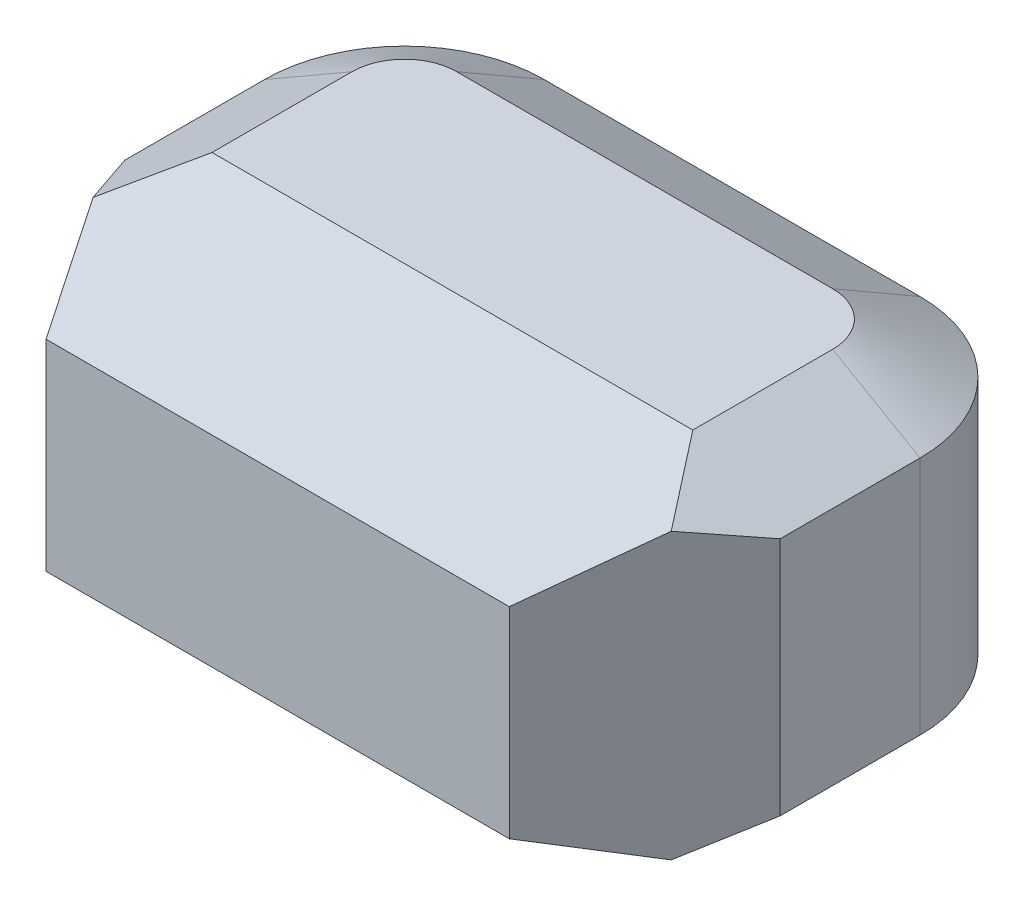
ISO-10303-21;
HEADER;
FILE_DESCRIPTION(('STEP AP214'),'2;1');
FILE_NAME('part.step','',(''),(''),'','','');
FILE_SCHEMA(('AUTOMOTIVE_DESIGN { 1 0 10303 214 1 1 1 1 }'));
ENDSEC;
DATA;
#1=APPLICATION_CONTEXT('core data for automotive mechanical design processes');
#2=APPLICATION_PROTOCOL_DEFINITION('international standard','automotive_design',2000,#1);
#3=PRODUCT_CONTEXT('',#1,'mechanical');
#4=PRODUCT('Part','Part','',(#3));
#5=PRODUCT_RELATED_PRODUCT_CATEGORY('part','',(#4));
#6=PRODUCT_DEFINITION_FORMATION('','',#4);
#7=PRODUCT_DEFINITION_CONTEXT('part definition',#1,'design');
#8=PRODUCT_DEFINITION('design','',#6,#7);
#9=PRODUCT_DEFINITION_SHAPE('','',#8);
#10=(LENGTH_UNIT() NAMED_UNIT(*) SI_UNIT(.MILLI.,.METRE.));
#11=(NAMED_UNIT(*) PLANE_ANGLE_UNIT() SI_UNIT($,.RADIAN.));
#12=(NAMED_UNIT(*) SI_UNIT($,.STERADIAN.) SOLID_ANGLE_UNIT());
#13=UNCERTAINTY_MEASURE_WITH_UNIT(LENGTH_MEASURE(1.E-05),#10,'distance_accuracy_value','');
#14=(GEOMETRIC_REPRESENTATION_CONTEXT(3) GLOBAL_UNCERTAINTY_ASSIGNED_CONTEXT((#13)) GLOBAL_UNIT_ASSIGNED_CONTEXT((#10,
#11,#12)) REPRESENTATION_CONTEXT('',''));
#15=CARTESIAN_POINT('',(0.,0.,0.));
#16=DIRECTION('',(0.,0.,1.));
#17=DIRECTION('',(1.,0.,0.));
#18=AXIS2_PLACEMENT_3D('',#15,#16,#17);
#19=CARTESIAN_POINT('',(-9.525,4.953,-10.668));
#20=DIRECTION('',(0.,-0.86602540378444,0.499999999999998));
#21=DIRECTION('',(0.,-0.499999999999998,-0.86602540378444));
#22=AXIS2_PLACEMENT_3D('',#19,#20,#21);
#23=PLANE('',#22);
#24=DIRECTION('',(1.,0.,0.));
#25=VECTOR('',#24,1.);
#26=CARTESIAN_POINT('',(-9.525,4.953,-10.668));
#27=LINE('',#26,#25);
#28=CARTESIAN_POINT('',(5.461,4.95300000000794,-10.6680000000112));
#29=VERTEX_POINT('',#28);
#30=CARTESIAN_POINT('',(-5.461,4.95300000000794,-10.6680000000112));
#31=VERTEX_POINT('',#30);
#32=EDGE_CURVE('E136',#29,#31,#27,.F.);
#33=ORIENTED_EDGE('',*,*,#32,.F.);
#34=DIRECTION('',(0.,0.499999999999998,0.86602540378444));
#35=VECTOR('',#34,1.);
#36=CARTESIAN_POINT('',(5.461,-288086.67215295,-499000.));
#37=LINE('',#36,#35);
#38=CARTESIAN_POINT('',(5.461,3.48653031627095,-13.2079999999766));
#39=VERTEX_POINT('',#38);
#40=EDGE_CURVE('E132',#39,#29,#37,.T.);
#41=ORIENTED_EDGE('',*,*,#40,.F.);
#42=DIRECTION('',(-1.,0.,0.));
#43=VECTOR('',#42,1.);
#44=CARTESIAN_POINT('',(-9.525,3.48653031625835,-13.208));
#45=LINE('',#44,#43);
#46=CARTESIAN_POINT('',(-5.461,3.48653031626934,-13.2079999999816));
#47=VERTEX_POINT('',#46);
#48=EDGE_CURVE('E228',#47,#39,#45,.F.);
#49=ORIENTED_EDGE('',*,*,#48,.F.);
#50=DIRECTION('',(0.,0.499999999999998,0.86602540378444));
#51=VECTOR('',#50,1.);
#52=CARTESIAN_POINT('',(-5.461,-288086.67215295,-499000.));
#53=LINE('',#52,#51);
#54=EDGE_CURVE('E180',#31,#47,#53,.F.);
#55=ORIENTED_EDGE('',*,*,#54,.F.);
#56=EDGE_LOOP('',(#33,#41,#49,#55));
#57=FACE_BOUND('',#56,.T.);
#58=ADVANCED_FACE('F16',(#57),#23,.F.);
#59=CARTESIAN_POINT('',(5.461,3.48653031630874,-9.144));
#60=DIRECTION('',(0.,-1.,0.));
#61=DIRECTION('',(0.,0.,-1.));
#62=AXIS2_PLACEMENT_3D('',#59,#60,#61);
#63=CONICAL_SURFACE('',#62,4.06399999990641,1.04719755118925);
#64=DIRECTION('',(0.86602540378444,-0.499999999999998,0.));
#65=VECTOR('',#64,1.);
#66=CARTESIAN_POINT('',(9.525,3.48653031625835,-9.144));
#67=LINE('',#66,#65);
#68=CARTESIAN_POINT('',(6.98499999998641,4.95300000000783,-9.144));
#69=VERTEX_POINT('',#68);
#70=CARTESIAN_POINT('',(9.525,3.48653031625835,-9.144));
#71=VERTEX_POINT('',#70);
#72=EDGE_CURVE('E129',#69,#71,#67,.T.);
#73=ORIENTED_EDGE('',*,*,#72,.T.);
#74=CARTESIAN_POINT('',(5.461,3.48653031625835,-9.144));
#75=DIRECTION('',(0.,1.,0.));
#76=DIRECTION('',(0.,0.,1.));
#77=AXIS2_PLACEMENT_3D('',#74,#75,#76);
#78=CIRCLE('',#77,4.064);
#79=EDGE_CURVE('E216',#39,#71,#78,.F.);
#80=ORIENTED_EDGE('',*,*,#79,.F.);
#81=ORIENTED_EDGE('',*,*,#40,.T.);
#82=CARTESIAN_POINT('',(5.461,4.95300000001566,-9.144));
#83=DIRECTION('',(0.,-1.,0.));
#84=DIRECTION('',(0.,0.,-1.));
#85=AXIS2_PLACEMENT_3D('',#82,#83,#84);
#86=CIRCLE('',#85,1.52400000000967);
#87=EDGE_CURVE('E19',#69,#29,#86,.F.);
#88=ORIENTED_EDGE('',*,*,#87,.F.);
#89=EDGE_LOOP('',(#73,#80,#81,#88));
#90=FACE_BOUND('',#89,.T.);
#91=ADVANCED_FACE('F127',(#90),#63,.T.);
#92=CARTESIAN_POINT('',(-9.525,4.953,-13.208));
#93=DIRECTION('',(0.,0.,-1.));
#94=DIRECTION('',(-1.,0.,0.));
#95=AXIS2_PLACEMENT_3D('',#92,#93,#94);
#96=PLANE('',#95);
#97=DIRECTION('',(0.,-1.,0.));
#98=VECTOR('',#97,1.);
#99=CARTESIAN_POINT('',(-5.461,-4.953,-13.208));
#100=LINE('',#99,#98);
#101=CARTESIAN_POINT('',(-5.461,-3.48653031629615,-13.2079999999856));
#102=VERTEX_POINT('',#101);
#103=EDGE_CURVE('E214',#47,#102,#100,.T.);
#104=ORIENTED_EDGE('',*,*,#103,.F.);
#105=ORIENTED_EDGE('',*,*,#48,.T.);
#106=DIRECTION('',(0.,1.,0.));
#107=VECTOR('',#106,1.);
#108=CARTESIAN_POINT('',(5.461,-4.953,-13.208));
#109=LINE('',#108,#107);
#110=CARTESIAN_POINT('',(5.461,-3.48653031629615,-13.2079999999856));
#111=VERTEX_POINT('',#110);
#112=EDGE_CURVE('E225',#111,#39,#109,.T.);
#113=ORIENTED_EDGE('',*,*,#112,.F.);
#114=DIRECTION('',(1.,0.,0.));
#115=VECTOR('',#114,1.);
#116=CARTESIAN_POINT('',(-9.525,-3.48653031625835,-13.208));
#117=LINE('',#116,#115);
#118=EDGE_CURVE('E219',#111,#102,#117,.F.);
#119=ORIENTED_EDGE('',*,*,#118,.T.);
#120=EDGE_LOOP('',(#104,#105,#113,#119));
#121=FACE_BOUND('',#120,.T.);
#122=ADVANCED_FACE('F394',(#121),#96,.T.);
#123=CARTESIAN_POINT('',(5.461,-4.953,-9.144));
#124=DIRECTION('',(0.,1.,0.));
#125=DIRECTION('',(0.,0.,1.));
#126=AXIS2_PLACEMENT_3D('',#123,#124,#125);
#127=CYLINDRICAL_SURFACE('',#126,4.064);
#128=ORIENTED_EDGE('',*,*,#112,.T.);
#129=ORIENTED_EDGE('',*,*,#79,.T.);
#130=DIRECTION('',(0.,1.,0.));
#131=VECTOR('',#130,1.);
#132=CARTESIAN_POINT('',(9.525,-4.953,-9.144));
#133=LINE('',#132,#131);
#134=CARTESIAN_POINT('',(9.52499999999479,-3.48653031627095,-9.144));
#135=VERTEX_POINT('',#134);
#136=EDGE_CURVE('E144',#135,#71,#133,.T.);
#137=ORIENTED_EDGE('',*,*,#136,.F.);
#138=CARTESIAN_POINT('',(5.461,-3.48653031630874,-9.144));
#139=DIRECTION('',(0.,1.,0.));
#140=DIRECTION('',(0.,0.,1.));
#141=AXIS2_PLACEMENT_3D('',#138,#139,#140);
#142=CIRCLE('',#141,4.06399999997915);
#143=EDGE_CURVE('E282',#111,#135,#142,.F.);
#144=ORIENTED_EDGE('',*,*,#143,.F.);
#145=EDGE_LOOP('',(#128,#129,#137,#144));
#146=FACE_BOUND('',#145,.T.);
#147=ADVANCED_FACE('F396',(#146),#127,.T.);
#148=CARTESIAN_POINT('',(-5.461,-4.953,-9.144));
#149=DIRECTION('',(0.,-1.,0.));
#150=DIRECTION('',(0.,0.,-1.));
#151=AXIS2_PLACEMENT_3D('',#148,#149,#150);
#152=CYLINDRICAL_SURFACE('',#151,4.064);
#153=DIRECTION('',(0.,1.,0.));
#154=VECTOR('',#153,1.);
#155=CARTESIAN_POINT('',(-9.525,-4.953,-9.144));
#156=LINE('',#155,#154);
#157=CARTESIAN_POINT('',(-9.52500000000502,3.48653031625673,-9.144));
#158=VERTEX_POINT('',#157);
#159=CARTESIAN_POINT('',(-9.52499999998936,-3.48653031628038,-9.144));
#160=VERTEX_POINT('',#159);
#161=EDGE_CURVE('E185',#158,#160,#156,.F.);
#162=ORIENTED_EDGE('',*,*,#161,.F.);
#163=CARTESIAN_POINT('',(-5.461,3.4865303162519,-9.144));
#164=DIRECTION('',(0.,-1.,0.));
#165=DIRECTION('',(0.,0.,-1.));
#166=AXIS2_PLACEMENT_3D('',#163,#164,#165);
#167=CIRCLE('',#166,4.06400000002009);
#168=EDGE_CURVE('E137',#47,#158,#167,.F.);
#169=ORIENTED_EDGE('',*,*,#168,.F.);
#170=ORIENTED_EDGE('',*,*,#103,.T.);
#171=CARTESIAN_POINT('',(-5.461,-3.48653031630874,-9.144));
#172=DIRECTION('',(0.,1.,0.));
#173=DIRECTION('',(0.,0.,1.));
#174=AXIS2_PLACEMENT_3D('',#171,#172,#173);
#175=CIRCLE('',#174,4.06399999997915);
#176=EDGE_CURVE('E189',#160,#102,#175,.F.);
#177=ORIENTED_EDGE('',*,*,#176,.F.);
#178=EDGE_LOOP('',(#162,#169,#170,#177));
#179=FACE_BOUND('',#178,.T.);
#180=ADVANCED_FACE('F574',(#179),#152,.T.);
#181=CARTESIAN_POINT('',(-5.461,3.48653031630874,-9.144));
#182=DIRECTION('',(0.,-1.,0.));
#183=DIRECTION('',(0.,0.,-1.));
#184=AXIS2_PLACEMENT_3D('',#181,#182,#183);
#185=CONICAL_SURFACE('',#184,4.06399999990641,1.04719755118925);
#186=ORIENTED_EDGE('',*,*,#54,.T.);
#187=ORIENTED_EDGE('',*,*,#168,.T.);
#188=DIRECTION('',(0.866025403784439,0.499999999999999,0.));
#189=VECTOR('',#188,1.);
#190=CARTESIAN_POINT('',(-6.98499999999998,4.953,-9.144));
#191=LINE('',#190,#189);
#192=CARTESIAN_POINT('',(-6.98499999998642,4.95300000000783,-9.144));
#193=VERTEX_POINT('',#192);
#194=EDGE_CURVE('E165',#158,#193,#191,.T.);
#195=ORIENTED_EDGE('',*,*,#194,.T.);
#196=CARTESIAN_POINT('',(-5.461,4.95300000001566,-9.144));
#197=DIRECTION('',(0.,-1.,0.));
#198=DIRECTION('',(0.,0.,-1.));
#199=AXIS2_PLACEMENT_3D('',#196,#197,#198);
#200=CIRCLE('',#199,1.52400000000967);
#201=EDGE_CURVE('E150',#31,#193,#200,.F.);
#202=ORIENTED_EDGE('',*,*,#201,.F.);
#203=EDGE_LOOP('',(#186,#187,#195,#202));
#204=FACE_BOUND('',#203,.T.);
#205=ADVANCED_FACE('F566',(#204),#185,.T.);
#206=CARTESIAN_POINT('',(-9.525,4.953,-13.208));
#207=DIRECTION('',(0.,1.,0.));
#208=DIRECTION('',(0.,0.,1.));
#209=AXIS2_PLACEMENT_3D('',#206,#207,#208);
#210=PLANE('',#209);
#211=ORIENTED_EDGE('',*,*,#201,.T.);
#212=DIRECTION('',(0.,0.,1.));
#213=VECTOR('',#212,1.);
#214=CARTESIAN_POINT('',(-6.98499999999998,4.953,-13.208));
#215=LINE('',#214,#213);
#216=CARTESIAN_POINT('',(-6.98499999999998,4.953,-5.08));
#217=VERTEX_POINT('',#216);
#218=EDGE_CURVE('E160',#193,#217,#215,.T.);
#219=ORIENTED_EDGE('',*,*,#218,.T.);
#220=DIRECTION('',(1.,0.,0.));
#221=VECTOR('',#220,1.);
#222=CARTESIAN_POINT('',(-10.16,4.953,-5.08));
#223=LINE('',#222,#221);
#224=CARTESIAN_POINT('',(6.98499999999998,4.953,-5.08));
#225=VERTEX_POINT('',#224);
#226=EDGE_CURVE('E149',#217,#225,#223,.T.);
#227=ORIENTED_EDGE('',*,*,#226,.T.);
#228=DIRECTION('',(0.,0.,1.));
#229=VECTOR('',#228,1.);
#230=CARTESIAN_POINT('',(6.98499999999998,4.953,-13.208));
#231=LINE('',#230,#229);
#232=EDGE_CURVE('E141',#225,#69,#231,.F.);
#233=ORIENTED_EDGE('',*,*,#232,.T.);
#234=ORIENTED_EDGE('',*,*,#87,.T.);
#235=ORIENTED_EDGE('',*,*,#32,.T.);
#236=EDGE_LOOP('',(#211,#219,#227,#233,#234,#235));
#237=FACE_BOUND('',#236,.T.);
#238=ADVANCED_FACE('F147',(#237),#210,.T.);
#239=CARTESIAN_POINT('',(9.525,3.48653031625835,-13.208));
#240=DIRECTION('',(-0.499999999999998,-0.86602540378444,0.));
#241=DIRECTION('',(0.86602540378444,-0.499999999999998,0.));
#242=AXIS2_PLACEMENT_3D('',#239,#240,#241);
#243=PLANE('',#242);
#244=DIRECTION('',(0.464282451503766,-0.268053598355716,-0.84414991182503));
#245=VECTOR('',#244,1.);
#246=CARTESIAN_POINT('',(8.4009437111578,4.13550451720568,-3.03626129301418));
#247=LINE('',#246,#245);
#248=CARTESIAN_POINT('',(8.4009437111578,4.13550451720568,-3.03626129301418));
#249=VERTEX_POINT('',#248);
#250=CARTESIAN_POINT('',(9.525,3.48653031625835,-5.08000000000001));
#251=VERTEX_POINT('',#250);
#252=EDGE_CURVE('E303',#249,#251,#247,.T.);
#253=ORIENTED_EDGE('',*,*,#252,.T.);
#254=DIRECTION('',(0.,0.,-1.));
#255=VECTOR('',#254,1.);
#256=CARTESIAN_POINT('',(9.525,3.48653031625835,-13.208));
#257=LINE('',#256,#255);
#258=EDGE_CURVE('E143',#71,#251,#257,.F.);
#259=ORIENTED_EDGE('',*,*,#258,.F.);
#260=ORIENTED_EDGE('',*,*,#72,.F.);
#261=ORIENTED_EDGE('',*,*,#232,.F.);
#262=DIRECTION('',(0.541001780800457,-0.312347523777212,0.780868809443032));
#263=VECTOR('',#262,1.);
#264=CARTESIAN_POINT('',(6.98499999999998,4.953,-5.08));
#265=LINE('',#264,#263);
#266=EDGE_CURVE('E159',#225,#249,#265,.T.);
#267=ORIENTED_EDGE('',*,*,#266,.T.);
#268=EDGE_LOOP('',(#253,#259,#260,#261,#267));
#269=FACE_BOUND('',#268,.T.);
#270=ADVANCED_FACE('F140',(#269),#243,.F.);
#271=CARTESIAN_POINT('',(9.525,-4.953,-13.208));
#272=DIRECTION('',(1.,0.,0.));
#273=DIRECTION('',(0.,0.,-1.));
#274=AXIS2_PLACEMENT_3D('',#271,#272,#273);
#275=PLANE('',#274);
#276=ORIENTED_EDGE('',*,*,#136,.T.);
#277=ORIENTED_EDGE('',*,*,#258,.T.);
#278=DIRECTION('',(0.,1.,0.));
#279=VECTOR('',#278,1.);
#280=CARTESIAN_POINT('',(9.525,-5.08,-5.08000000000001));
#281=LINE('',#280,#279);
#282=CARTESIAN_POINT('',(9.525,-3.48653031625835,-5.08));
#283=VERTEX_POINT('',#282);
#284=EDGE_CURVE('E299',#251,#283,#281,.F.);
#285=ORIENTED_EDGE('',*,*,#284,.T.);
#286=DIRECTION('',(0.,0.,1.));
#287=VECTOR('',#286,1.);
#288=CARTESIAN_POINT('',(9.525,-3.48653031625835,-13.208));
#289=LINE('',#288,#287);
#290=EDGE_CURVE('E258',#283,#135,#289,.F.);
#291=ORIENTED_EDGE('',*,*,#290,.T.);
#292=EDGE_LOOP('',(#276,#277,#285,#291));
#293=FACE_BOUND('',#292,.T.);
#294=ADVANCED_FACE('F398',(#293),#275,.T.);
#295=CARTESIAN_POINT('',(-9.525,-4.953,-10.668));
#296=DIRECTION('',(0.,0.86602540378444,0.499999999999998));
#297=DIRECTION('',(0.,-0.499999999999998,0.86602540378444));
#298=AXIS2_PLACEMENT_3D('',#295,#296,#297);
#299=PLANE('',#298);
#300=DIRECTION('',(1.,0.,0.));
#301=VECTOR('',#300,1.);
#302=CARTESIAN_POINT('',(-9.525,-4.953,-10.668));
#303=LINE('',#302,#301);
#304=CARTESIAN_POINT('',(-5.461,-4.95300000001233,-10.6680000000112));
#305=VERTEX_POINT('',#304);
#306=CARTESIAN_POINT('',(5.461,-4.95300000002905,-10.6679999999804));
#307=VERTEX_POINT('',#306);
#308=EDGE_CURVE('E249',#305,#307,#303,.T.);
#309=ORIENTED_EDGE('',*,*,#308,.F.);
#310=DIRECTION('',(0.,-0.499999999999998,0.86602540378444));
#311=VECTOR('',#310,1.);
#312=CARTESIAN_POINT('',(-5.46099999993889,288097.230734673,-499018.288));
#313=LINE('',#312,#311);
#314=EDGE_CURVE('E206',#102,#305,#313,.T.);
#315=ORIENTED_EDGE('',*,*,#314,.F.);
#316=ORIENTED_EDGE('',*,*,#118,.F.);
#317=DIRECTION('',(0.,-0.499999999999998,0.86602540378444));
#318=VECTOR('',#317,1.);
#319=CARTESIAN_POINT('',(5.46100000006111,288097.230734673,-499018.288));
#320=LINE('',#319,#318);
#321=EDGE_CURVE('E222',#307,#111,#320,.F.);
#322=ORIENTED_EDGE('',*,*,#321,.F.);
#323=EDGE_LOOP('',(#309,#315,#316,#322));
#324=FACE_BOUND('',#323,.T.);
#325=ADVANCED_FACE('F386',(#324),#299,.F.);
#326=CARTESIAN_POINT('',(5.461,-3.48653031630874,-9.144));
#327=DIRECTION('',(0.,1.,0.));
#328=DIRECTION('',(0.,0.,1.));
#329=AXIS2_PLACEMENT_3D('',#326,#327,#328);
#330=CONICAL_SURFACE('',#329,4.06399999997915,1.04719755119634);
#331=ORIENTED_EDGE('',*,*,#321,.T.);
#332=ORIENTED_EDGE('',*,*,#143,.T.);
#333=DIRECTION('',(-0.86602540378444,-0.499999999999998,0.));
#334=VECTOR('',#333,1.);
#335=CARTESIAN_POINT('',(6.98499999999998,-4.953,-9.144));
#336=LINE('',#335,#334);
#337=CARTESIAN_POINT('',(6.98499999997483,-4.95300000001452,-9.144));
#338=VERTEX_POINT('',#337);
#339=EDGE_CURVE('E252',#135,#338,#336,.T.);
#340=ORIENTED_EDGE('',*,*,#339,.T.);
#341=CARTESIAN_POINT('',(5.461,-4.95300000002905,-9.144));
#342=DIRECTION('',(0.,1.,0.));
#343=DIRECTION('',(0.,0.,1.));
#344=AXIS2_PLACEMENT_3D('',#341,#342,#343);
#345=CIRCLE('',#344,1.52400000001762);
#346=EDGE_CURVE('E246',#307,#338,#345,.F.);
#347=ORIENTED_EDGE('',*,*,#346,.F.);
#348=EDGE_LOOP('',(#331,#332,#340,#347));
#349=FACE_BOUND('',#348,.T.);
#350=ADVANCED_FACE('F388',(#349),#330,.T.);
#351=CARTESIAN_POINT('',(-5.461,-3.48653031630874,-9.144));
#352=DIRECTION('',(0.,1.,0.));
#353=DIRECTION('',(0.,0.,1.));
#354=AXIS2_PLACEMENT_3D('',#351,#352,#353);
#355=CONICAL_SURFACE('',#354,4.06399999997915,1.04719755119634);
#356=DIRECTION('',(-0.866025403784439,0.499999999999999,0.));
#357=VECTOR('',#356,1.);
#358=CARTESIAN_POINT('',(-9.525,-3.48653031625835,-9.144));
#359=LINE('',#358,#357);
#360=CARTESIAN_POINT('',(-6.98499999997881,-4.95300000001223,-9.144));
#361=VERTEX_POINT('',#360);
#362=EDGE_CURVE('E211',#361,#160,#359,.T.);
#363=ORIENTED_EDGE('',*,*,#362,.T.);
#364=ORIENTED_EDGE('',*,*,#176,.T.);
#365=ORIENTED_EDGE('',*,*,#314,.T.);
#366=CARTESIAN_POINT('',(-5.461,-4.95300000002445,-9.144));
#367=DIRECTION('',(0.,1.,0.));
#368=DIRECTION('',(0.,0.,1.));
#369=AXIS2_PLACEMENT_3D('',#366,#367,#368);
#370=CIRCLE('',#369,1.52400000002557);
#371=EDGE_CURVE('E250',#361,#305,#370,.F.);
#372=ORIENTED_EDGE('',*,*,#371,.F.);
#373=EDGE_LOOP('',(#363,#364,#365,#372));
#374=FACE_BOUND('',#373,.T.);
#375=ADVANCED_FACE('F383',(#374),#355,.T.);
#376=CARTESIAN_POINT('',(-9.525,-4.953,-13.208));
#377=DIRECTION('',(-1.,0.,0.));
#378=DIRECTION('',(0.,0.,1.));
#379=AXIS2_PLACEMENT_3D('',#376,#377,#378);
#380=PLANE('',#379);
#381=DIRECTION('',(0.,1.,0.));
#382=VECTOR('',#381,1.);
#383=CARTESIAN_POINT('',(-9.525,-5.08,-5.08));
#384=LINE('',#383,#382);
#385=CARTESIAN_POINT('',(-9.525,-3.48653031625835,-5.08));
#386=VERTEX_POINT('',#385);
#387=CARTESIAN_POINT('',(-9.525,3.48653031625834,-5.08));
#388=VERTEX_POINT('',#387);
#389=EDGE_CURVE('E196',#386,#388,#384,.T.);
#390=ORIENTED_EDGE('',*,*,#389,.T.);
#391=DIRECTION('',(0.,0.,1.));
#392=VECTOR('',#391,1.);
#393=CARTESIAN_POINT('',(-9.525,3.48653031625834,-13.208));
#394=LINE('',#393,#392);
#395=EDGE_CURVE('E176',#388,#158,#394,.F.);
#396=ORIENTED_EDGE('',*,*,#395,.T.);
#397=ORIENTED_EDGE('',*,*,#161,.T.);
#398=DIRECTION('',(0.,0.,1.));
#399=VECTOR('',#398,1.);
#400=CARTESIAN_POINT('',(-9.525,-3.48653031625835,-13.208));
#401=LINE('',#400,#399);
#402=EDGE_CURVE('E201',#160,#386,#401,.T.);
#403=ORIENTED_EDGE('',*,*,#402,.T.);
#404=EDGE_LOOP('',(#390,#396,#397,#403));
#405=FACE_BOUND('',#404,.T.);
#406=ADVANCED_FACE('F377',(#405),#380,.T.);
#407=CARTESIAN_POINT('',(-6.98499999999998,4.953,-13.208));
#408=DIRECTION('',(0.499999999999999,-0.866025403784439,0.));
#409=DIRECTION('',(0.866025403784439,0.499999999999999,0.));
#410=AXIS2_PLACEMENT_3D('',#407,#408,#409);
#411=PLANE('',#410);
#412=ORIENTED_EDGE('',*,*,#218,.F.);
#413=ORIENTED_EDGE('',*,*,#194,.F.);
#414=ORIENTED_EDGE('',*,*,#395,.F.);
#415=DIRECTION('',(0.464282451503766,0.268053598355719,0.844149911825029));
#416=VECTOR('',#415,1.);
#417=CARTESIAN_POINT('',(-9.525,3.48653031625835,-5.08));
#418=LINE('',#417,#416);
#419=CARTESIAN_POINT('',(-8.4009437111578,4.13550451720568,-3.03626129301419));
#420=VERTEX_POINT('',#419);
#421=EDGE_CURVE('E192',#388,#420,#418,.T.);
#422=ORIENTED_EDGE('',*,*,#421,.T.);
#423=DIRECTION('',(0.54100178080046,0.312347523777212,-0.78086880944303));
#424=VECTOR('',#423,1.);
#425=CARTESIAN_POINT('',(-8.4009437111578,4.13550451720567,-3.03626129301419));
#426=LINE('',#425,#424);
#427=EDGE_CURVE('E168',#420,#217,#426,.T.);
#428=ORIENTED_EDGE('',*,*,#427,.T.);
#429=EDGE_LOOP('',(#412,#413,#414,#422,#428));
#430=FACE_BOUND('',#429,.T.);
#431=ADVANCED_FACE('F429',(#430),#411,.F.);
#432=CARTESIAN_POINT('',(-10.16,4.953,-5.08));
#433=DIRECTION('',(0.,-0.928476690885259,-0.371390676354104));
#434=DIRECTION('',(0.,0.371390676354104,-0.928476690885259));
#435=AXIS2_PLACEMENT_3D('',#432,#433,#434);
#436=PLANE('',#435);
#437=DIRECTION('',(0.454794026827098,-0.330759292237889,0.826898230594723));
#438=VECTOR('',#437,1.);
#439=CARTESIAN_POINT('',(-8.4009437111578,4.13550451720568,-3.03626129301419));
#440=LINE('',#439,#438);
#441=CARTESIAN_POINT('',(-6.731,2.921,0.));
#442=VERTEX_POINT('',#441);
#443=EDGE_CURVE('E195',#420,#442,#440,.T.);
#444=ORIENTED_EDGE('',*,*,#443,.T.);
#445=DIRECTION('',(-1.,0.,0.));
#446=VECTOR('',#445,1.);
#447=CARTESIAN_POINT('',(-9.525,2.921,0.));
#448=LINE('',#447,#446);
#449=CARTESIAN_POINT('',(6.731,2.921,0.));
#450=VERTEX_POINT('',#449);
#451=EDGE_CURVE('E326',#442,#450,#448,.F.);
#452=ORIENTED_EDGE('',*,*,#451,.T.);
#453=DIRECTION('',(0.454794026827097,0.33075929223789,-0.826898230594723));
#454=VECTOR('',#453,1.);
#455=CARTESIAN_POINT('',(6.731,2.921,0.));
#456=LINE('',#455,#454);
#457=EDGE_CURVE('E171',#450,#249,#456,.T.);
#458=ORIENTED_EDGE('',*,*,#457,.T.);
#459=ORIENTED_EDGE('',*,*,#266,.F.);
#460=ORIENTED_EDGE('',*,*,#226,.F.);
#461=ORIENTED_EDGE('',*,*,#427,.F.);
#462=EDGE_LOOP('',(#444,#452,#458,#459,#460,#461));
#463=FACE_BOUND('',#462,.T.);
#464=ADVANCED_FACE('F426',(#463),#436,.F.);
#465=CARTESIAN_POINT('',(6.731,-5.08,0.));
#466=DIRECTION('',(-0.876215908676647,0.,-0.481918749772156));
#467=DIRECTION('',(-0.481918749772156,0.,0.876215908676647));
#468=AXIS2_PLACEMENT_3D('',#465,#466,#467);
#469=PLANE('',#468);
#470=DIRECTION('',(0.454794026827098,-0.330759292237889,-0.826898230594723));
#471=VECTOR('',#470,1.);
#472=CARTESIAN_POINT('',(6.731,-2.921,0.));
#473=LINE('',#472,#471);
#474=CARTESIAN_POINT('',(6.731,-2.921,0.));
#475=VERTEX_POINT('',#474);
#476=CARTESIAN_POINT('',(8.40094371115781,-4.13550451720568,-3.0362612930142));
#477=VERTEX_POINT('',#476);
#478=EDGE_CURVE('E277',#475,#477,#473,.T.);
#479=ORIENTED_EDGE('',*,*,#478,.T.);
#480=DIRECTION('',(0.464282451503766,0.268053598355717,-0.84414991182503));
#481=VECTOR('',#480,1.);
#482=CARTESIAN_POINT('',(8.4009437111578,-4.13550451720568,-3.03626129301419));
#483=LINE('',#482,#481);
#484=EDGE_CURVE('E265',#477,#283,#483,.T.);
#485=ORIENTED_EDGE('',*,*,#484,.T.);
#486=ORIENTED_EDGE('',*,*,#284,.F.);
#487=ORIENTED_EDGE('',*,*,#252,.F.);
#488=ORIENTED_EDGE('',*,*,#457,.F.);
#489=DIRECTION('',(0.,1.,0.));
#490=VECTOR('',#489,1.);
#491=CARTESIAN_POINT('',(6.731,4.953,0.));
#492=LINE('',#491,#490);
#493=EDGE_CURVE('E323',#450,#475,#492,.F.);
#494=ORIENTED_EDGE('',*,*,#493,.T.);
#495=EDGE_LOOP('',(#479,#485,#486,#487,#488,#494));
#496=FACE_BOUND('',#495,.T.);
#497=ADVANCED_FACE('F368',(#496),#469,.F.);
#498=CARTESIAN_POINT('',(6.98499999999998,-4.953,-13.208));
#499=DIRECTION('',(-0.499999999999998,0.86602540378444,0.));
#500=DIRECTION('',(-0.86602540378444,-0.499999999999998,0.));
#501=AXIS2_PLACEMENT_3D('',#498,#499,#500);
#502=PLANE('',#501);
#503=DIRECTION('',(0.,0.,-1.));
#504=VECTOR('',#503,1.);
#505=CARTESIAN_POINT('',(6.98499999999998,-4.953,-13.208));
#506=LINE('',#505,#504);
#507=CARTESIAN_POINT('',(6.98499999999999,-4.953,-5.08));
#508=VERTEX_POINT('',#507);
#509=EDGE_CURVE('E248',#338,#508,#506,.F.);
#510=ORIENTED_EDGE('',*,*,#509,.F.);
#511=ORIENTED_EDGE('',*,*,#339,.F.);
#512=ORIENTED_EDGE('',*,*,#290,.F.);
#513=ORIENTED_EDGE('',*,*,#484,.F.);
#514=DIRECTION('',(-0.541001780800461,-0.312347523777212,-0.780868809443029));
#515=VECTOR('',#514,1.);
#516=CARTESIAN_POINT('',(8.40094371115781,-4.13550451720568,-3.03626129301419));
#517=LINE('',#516,#515);
#518=EDGE_CURVE('E273',#477,#508,#517,.T.);
#519=ORIENTED_EDGE('',*,*,#518,.T.);
#520=EDGE_LOOP('',(#510,#511,#512,#513,#519));
#521=FACE_BOUND('',#520,.T.);
#522=ADVANCED_FACE('F364',(#521),#502,.F.);
#523=CARTESIAN_POINT('',(-9.525,-4.953,-13.208));
#524=DIRECTION('',(0.,-1.,0.));
#525=DIRECTION('',(0.,0.,-1.));
#526=AXIS2_PLACEMENT_3D('',#523,#524,#525);
#527=PLANE('',#526);
#528=ORIENTED_EDGE('',*,*,#346,.T.);
#529=ORIENTED_EDGE('',*,*,#509,.T.);
#530=DIRECTION('',(1.,0.,0.));
#531=VECTOR('',#530,1.);
#532=CARTESIAN_POINT('',(-10.16,-4.953,-5.08));
#533=LINE('',#532,#531);
#534=CARTESIAN_POINT('',(-6.98499999999998,-4.953,-5.08));
#535=VERTEX_POINT('',#534);
#536=EDGE_CURVE('E276',#508,#535,#533,.F.);
#537=ORIENTED_EDGE('',*,*,#536,.T.);
#538=DIRECTION('',(0.,0.,1.));
#539=VECTOR('',#538,1.);
#540=CARTESIAN_POINT('',(-6.98499999999998,-4.953,-13.208));
#541=LINE('',#540,#539);
#542=EDGE_CURVE('E342',#535,#361,#541,.F.);
#543=ORIENTED_EDGE('',*,*,#542,.T.);
#544=ORIENTED_EDGE('',*,*,#371,.T.);
#545=ORIENTED_EDGE('',*,*,#308,.T.);
#546=EDGE_LOOP('',(#528,#529,#537,#543,#544,#545));
#547=FACE_BOUND('',#546,.T.);
#548=ADVANCED_FACE('F357',(#547),#527,.T.);
#549=CARTESIAN_POINT('',(-9.525,-3.48653031625835,-13.208));
#550=DIRECTION('',(0.499999999999999,0.866025403784439,0.));
#551=DIRECTION('',(-0.866025403784439,0.499999999999999,0.));
#552=AXIS2_PLACEMENT_3D('',#549,#550,#551);
#553=PLANE('',#552);
#554=DIRECTION('',(-0.464282451503766,0.268053598355718,-0.844149911825029));
#555=VECTOR('',#554,1.);
#556=CARTESIAN_POINT('',(-8.4009437111578,-4.13550451720568,-3.03626129301419));
#557=LINE('',#556,#555);
#558=CARTESIAN_POINT('',(-8.4009437111578,-4.13550451720568,-3.03626129301419));
#559=VERTEX_POINT('',#558);
#560=EDGE_CURVE('E329',#559,#386,#557,.T.);
#561=ORIENTED_EDGE('',*,*,#560,.T.);
#562=ORIENTED_EDGE('',*,*,#402,.F.);
#563=ORIENTED_EDGE('',*,*,#362,.F.);
#564=ORIENTED_EDGE('',*,*,#542,.F.);
#565=DIRECTION('',(-0.541001780800461,0.312347523777212,0.780868809443029));
#566=VECTOR('',#565,1.);
#567=CARTESIAN_POINT('',(-6.98499999999998,-4.953,-5.08));
#568=LINE('',#567,#566);
#569=EDGE_CURVE('E352',#535,#559,#568,.T.);
#570=ORIENTED_EDGE('',*,*,#569,.T.);
#571=EDGE_LOOP('',(#561,#562,#563,#564,#570));
#572=FACE_BOUND('',#571,.T.);
#573=ADVANCED_FACE('F381',(#572),#553,.F.);
#574=CARTESIAN_POINT('',(-9.525,-5.08,-5.08));
#575=DIRECTION('',(0.876215908676647,0.,-0.481918749772156));
#576=DIRECTION('',(-0.481918749772156,0.,-0.876215908676647));
#577=AXIS2_PLACEMENT_3D('',#574,#575,#576);
#578=PLANE('',#577);
#579=DIRECTION('',(0.454794026827098,0.330759292237889,0.826898230594723));
#580=VECTOR('',#579,1.);
#581=CARTESIAN_POINT('',(-8.4009437111578,-4.13550451720568,-3.03626129301419));
#582=LINE('',#581,#580);
#583=CARTESIAN_POINT('',(-6.731,-2.921,0.));
#584=VERTEX_POINT('',#583);
#585=EDGE_CURVE('E25',#559,#584,#582,.T.);
#586=ORIENTED_EDGE('',*,*,#585,.T.);
#587=DIRECTION('',(0.,1.,0.));
#588=VECTOR('',#587,1.);
#589=CARTESIAN_POINT('',(-6.731,4.953,0.));
#590=LINE('',#589,#588);
#591=EDGE_CURVE('E33',#584,#442,#590,.T.);
#592=ORIENTED_EDGE('',*,*,#591,.T.);
#593=ORIENTED_EDGE('',*,*,#443,.F.);
#594=ORIENTED_EDGE('',*,*,#421,.F.);
#595=ORIENTED_EDGE('',*,*,#389,.F.);
#596=ORIENTED_EDGE('',*,*,#560,.F.);
#597=EDGE_LOOP('',(#586,#592,#593,#594,#595,#596));
#598=FACE_BOUND('',#597,.T.);
#599=ADVANCED_FACE('F373',(#598),#578,.F.);
#600=CARTESIAN_POINT('',(-9.525,4.953,0.));
#601=DIRECTION('',(0.,0.,-1.));
#602=DIRECTION('',(-1.,0.,0.));
#603=AXIS2_PLACEMENT_3D('',#600,#601,#602);
#604=PLANE('',#603);
#605=DIRECTION('',(1.,0.,0.));
#606=VECTOR('',#605,1.);
#607=CARTESIAN_POINT('',(-10.16,-2.921,0.));
#608=LINE('',#607,#606);
#609=EDGE_CURVE('E11',#584,#475,#608,.T.);
#610=ORIENTED_EDGE('',*,*,#609,.T.);
#611=ORIENTED_EDGE('',*,*,#493,.F.);
#612=ORIENTED_EDGE('',*,*,#451,.F.);
#613=ORIENTED_EDGE('',*,*,#591,.F.);
#614=EDGE_LOOP('',(#610,#611,#612,#613));
#615=FACE_BOUND('',#614,.T.);
#616=ADVANCED_FACE('F409',(#615),#604,.F.);
#617=CARTESIAN_POINT('',(-10.16,-4.953,-5.08));
#618=DIRECTION('',(0.,0.928476690885259,-0.371390676354104));
#619=DIRECTION('',(0.,0.371390676354104,0.928476690885259));
#620=AXIS2_PLACEMENT_3D('',#617,#618,#619);
#621=PLANE('',#620);
#622=ORIENTED_EDGE('',*,*,#585,.F.);
#623=ORIENTED_EDGE('',*,*,#569,.F.);
#624=ORIENTED_EDGE('',*,*,#536,.F.);
#625=ORIENTED_EDGE('',*,*,#518,.F.);
#626=ORIENTED_EDGE('',*,*,#478,.F.);
#627=ORIENTED_EDGE('',*,*,#609,.F.);
#628=EDGE_LOOP('',(#622,#623,#624,#625,#626,#627));
#629=FACE_BOUND('',#628,.T.);
#630=ADVANCED_FACE('F362',(#629),#621,.F.);
#631=CLOSED_SHELL('',(#58,#91,#122,#147,#180,#205,#238,#270,#294,#325,#350,#375,#406,#431,#464,
#497,#522,#548,#573,#599,#616,#630));
#632=MANIFOLD_SOLID_BREP('B1',#631);
#633=ADVANCED_BREP_SHAPE_REPRESENTATION('',(#18,#632),#14);
#634=SHAPE_DEFINITION_REPRESENTATION(#9,#633);
ENDSEC;
END-ISO-10303-21;
